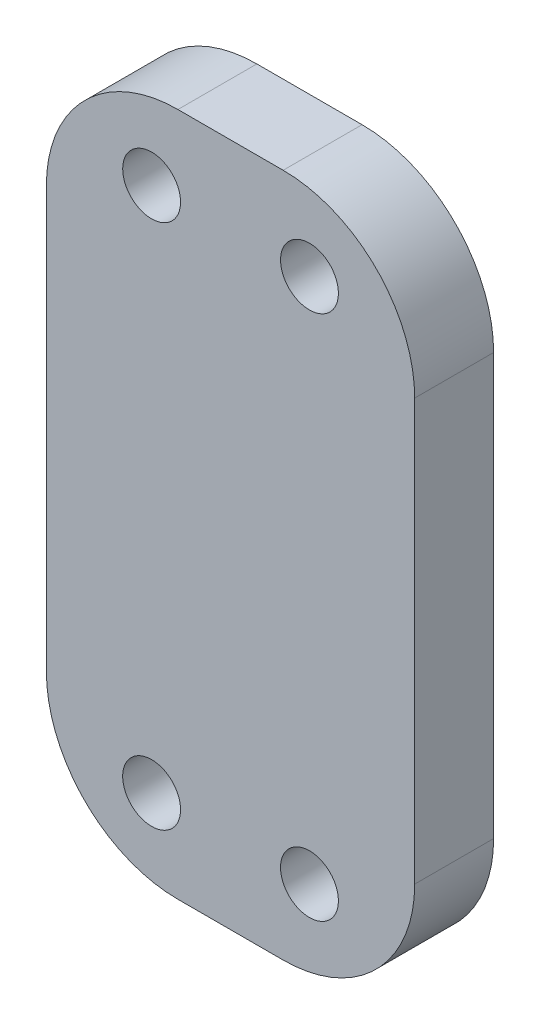
ISO-10303-21;
HEADER;
FILE_DESCRIPTION(('STEP AP214'),'2;1');
FILE_NAME('part.step','',(''),(''),'','','');
FILE_SCHEMA(('AUTOMOTIVE_DESIGN { 1 0 10303 214 1 1 1 1 }'));
ENDSEC;
DATA;
#1=APPLICATION_CONTEXT('core data for automotive mechanical design processes');
#2=APPLICATION_PROTOCOL_DEFINITION('international standard','automotive_design',2000,#1);
#3=PRODUCT_CONTEXT('',#1,'mechanical');
#4=PRODUCT('Part','Part','',(#3));
#5=PRODUCT_RELATED_PRODUCT_CATEGORY('part','',(#4));
#6=PRODUCT_DEFINITION_FORMATION('','',#4);
#7=PRODUCT_DEFINITION_CONTEXT('part definition',#1,'design');
#8=PRODUCT_DEFINITION('design','',#6,#7);
#9=PRODUCT_DEFINITION_SHAPE('','',#8);
#10=(LENGTH_UNIT() NAMED_UNIT(*) SI_UNIT(.MILLI.,.METRE.));
#11=(NAMED_UNIT(*) PLANE_ANGLE_UNIT() SI_UNIT($,.RADIAN.));
#12=(NAMED_UNIT(*) SI_UNIT($,.STERADIAN.) SOLID_ANGLE_UNIT());
#13=UNCERTAINTY_MEASURE_WITH_UNIT(LENGTH_MEASURE(1.E-05),#10,'distance_accuracy_value','');
#14=(GEOMETRIC_REPRESENTATION_CONTEXT(3) GLOBAL_UNCERTAINTY_ASSIGNED_CONTEXT((#13)) GLOBAL_UNIT_ASSIGNED_CONTEXT((#10,
#11,#12)) REPRESENTATION_CONTEXT('',''));
#15=CARTESIAN_POINT('',(0.,0.,0.));
#16=DIRECTION('',(0.,0.,1.));
#17=DIRECTION('',(1.,0.,0.));
#18=AXIS2_PLACEMENT_3D('',#15,#16,#17);
#19=CARTESIAN_POINT('',(0.,0.,3.));
#20=DIRECTION('',(0.,0.,1.));
#21=DIRECTION('',(1.,0.,0.));
#22=AXIS2_PLACEMENT_3D('',#19,#20,#21);
#23=PLANE('',#22);
#24=CARTESIAN_POINT('',(3.,-10.,3.));
#25=DIRECTION('',(0.,0.,1.));
#26=DIRECTION('',(-1.,0.,0.));
#27=AXIS2_PLACEMENT_3D('',#24,#25,#26);
#28=CIRCLE('',#27,1.1);
#29=CARTESIAN_POINT('',(1.9,-10.,3.));
#30=VERTEX_POINT('',#29);
#31=EDGE_CURVE('E189',#30,#30,#28,.T.);
#32=ORIENTED_EDGE('',*,*,#31,.F.);
#33=EDGE_LOOP('',(#32));
#34=FACE_BOUND('',#33,.T.);
#35=CARTESIAN_POINT('',(3.,10.,3.));
#36=DIRECTION('',(0.,0.,1.));
#37=DIRECTION('',(1.,0.,0.));
#38=AXIS2_PLACEMENT_3D('',#35,#36,#37);
#39=CIRCLE('',#38,1.1);
#40=CARTESIAN_POINT('',(4.1,10.,3.));
#41=VERTEX_POINT('',#40);
#42=EDGE_CURVE('E175',#41,#41,#39,.T.);
#43=ORIENTED_EDGE('',*,*,#42,.F.);
#44=EDGE_LOOP('',(#43));
#45=FACE_BOUND('',#44,.T.);
#46=DIRECTION('',(1.,0.,0.));
#47=VECTOR('',#46,1.);
#48=CARTESIAN_POINT('',(7.,-13.,3.));
#49=LINE('',#48,#47);
#50=CARTESIAN_POINT('',(-2.,-13.,3.));
#51=VERTEX_POINT('',#50);
#52=CARTESIAN_POINT('',(2.,-13.,3.));
#53=VERTEX_POINT('',#52);
#54=EDGE_CURVE('E169',#51,#53,#49,.T.);
#55=ORIENTED_EDGE('',*,*,#54,.T.);
#56=CARTESIAN_POINT('',(2.,-8.,3.));
#57=DIRECTION('',(0.,0.,1.));
#58=DIRECTION('',(1.,0.,0.));
#59=AXIS2_PLACEMENT_3D('',#56,#57,#58);
#60=CIRCLE('',#59,5.);
#61=CARTESIAN_POINT('',(7.,-8.,3.));
#62=VERTEX_POINT('',#61);
#63=EDGE_CURVE('E149',#53,#62,#60,.T.);
#64=ORIENTED_EDGE('',*,*,#63,.T.);
#65=DIRECTION('',(0.,1.,0.));
#66=VECTOR('',#65,1.);
#67=CARTESIAN_POINT('',(7.,-13.,3.));
#68=LINE('',#67,#66);
#69=CARTESIAN_POINT('',(7.,7.99999999999999,3.));
#70=VERTEX_POINT('',#69);
#71=EDGE_CURVE('E119',#62,#70,#68,.T.);
#72=ORIENTED_EDGE('',*,*,#71,.T.);
#73=CARTESIAN_POINT('',(2.,8.,3.));
#74=DIRECTION('',(0.,0.,1.));
#75=DIRECTION('',(1.,0.,0.));
#76=AXIS2_PLACEMENT_3D('',#73,#74,#75);
#77=CIRCLE('',#76,5.);
#78=CARTESIAN_POINT('',(2.,13.,3.));
#79=VERTEX_POINT('',#78);
#80=EDGE_CURVE('E55',#70,#79,#77,.T.);
#81=ORIENTED_EDGE('',*,*,#80,.T.);
#82=DIRECTION('',(-1.,0.,0.));
#83=VECTOR('',#82,1.);
#84=CARTESIAN_POINT('',(7.,13.,3.));
#85=LINE('',#84,#83);
#86=CARTESIAN_POINT('',(-2.,13.,3.));
#87=VERTEX_POINT('',#86);
#88=EDGE_CURVE('E136',#79,#87,#85,.T.);
#89=ORIENTED_EDGE('',*,*,#88,.T.);
#90=CARTESIAN_POINT('',(-2.,8.,3.));
#91=DIRECTION('',(0.,0.,1.));
#92=DIRECTION('',(1.,0.,0.));
#93=AXIS2_PLACEMENT_3D('',#90,#91,#92);
#94=CIRCLE('',#93,5.);
#95=CARTESIAN_POINT('',(-7.,7.99999999999999,3.));
#96=VERTEX_POINT('',#95);
#97=EDGE_CURVE('E144',#87,#96,#94,.T.);
#98=ORIENTED_EDGE('',*,*,#97,.T.);
#99=DIRECTION('',(0.,-1.,0.));
#100=VECTOR('',#99,1.);
#101=CARTESIAN_POINT('',(-7.,-13.,3.));
#102=LINE('',#101,#100);
#103=CARTESIAN_POINT('',(-7.,-8.,3.));
#104=VERTEX_POINT('',#103);
#105=EDGE_CURVE('E130',#96,#104,#102,.T.);
#106=ORIENTED_EDGE('',*,*,#105,.T.);
#107=CARTESIAN_POINT('',(-2.,-8.,3.));
#108=DIRECTION('',(0.,0.,1.));
#109=DIRECTION('',(1.,0.,0.));
#110=AXIS2_PLACEMENT_3D('',#107,#108,#109);
#111=CIRCLE('',#110,5.);
#112=EDGE_CURVE('E147',#104,#51,#111,.T.);
#113=ORIENTED_EDGE('',*,*,#112,.T.);
#114=EDGE_LOOP('',(#55,#64,#72,#81,#89,#98,#106,#113));
#115=FACE_BOUND('',#114,.T.);
#116=CARTESIAN_POINT('',(-3.,10.,3.));
#117=DIRECTION('',(0.,0.,1.));
#118=DIRECTION('',(-1.,0.,0.));
#119=AXIS2_PLACEMENT_3D('',#116,#117,#118);
#120=CIRCLE('',#119,1.1);
#121=CARTESIAN_POINT('',(-4.1,10.,3.));
#122=VERTEX_POINT('',#121);
#123=EDGE_CURVE('E184',#122,#122,#120,.T.);
#124=ORIENTED_EDGE('',*,*,#123,.F.);
#125=EDGE_LOOP('',(#124));
#126=FACE_BOUND('',#125,.T.);
#127=CARTESIAN_POINT('',(-3.,-10.,3.));
#128=DIRECTION('',(0.,0.,1.));
#129=DIRECTION('',(1.,0.,0.));
#130=AXIS2_PLACEMENT_3D('',#127,#128,#129);
#131=CIRCLE('',#130,1.1);
#132=CARTESIAN_POINT('',(-1.9,-10.,3.));
#133=VERTEX_POINT('',#132);
#134=EDGE_CURVE('E195',#133,#133,#131,.T.);
#135=ORIENTED_EDGE('',*,*,#134,.F.);
#136=EDGE_LOOP('',(#135));
#137=FACE_BOUND('',#136,.T.);
#138=ADVANCED_FACE('F34',(#34,#45,#115,#126,#137),#23,.T.);
#139=CARTESIAN_POINT('',(0.,0.,0.));
#140=DIRECTION('',(0.,0.,1.));
#141=DIRECTION('',(1.,0.,0.));
#142=AXIS2_PLACEMENT_3D('',#139,#140,#141);
#143=PLANE('',#142);
#144=DIRECTION('',(0.,1.,0.));
#145=VECTOR('',#144,1.);
#146=CARTESIAN_POINT('',(7.,-13.,0.));
#147=LINE('',#146,#145);
#148=CARTESIAN_POINT('',(7.,-8.,0.));
#149=VERTEX_POINT('',#148);
#150=CARTESIAN_POINT('',(7.,7.99999999999999,0.));
#151=VERTEX_POINT('',#150);
#152=EDGE_CURVE('E117',#149,#151,#147,.T.);
#153=ORIENTED_EDGE('',*,*,#152,.F.);
#154=CARTESIAN_POINT('',(2.,-8.,0.));
#155=DIRECTION('',(0.,0.,1.));
#156=DIRECTION('',(1.,0.,0.));
#157=AXIS2_PLACEMENT_3D('',#154,#155,#156);
#158=CIRCLE('',#157,5.);
#159=CARTESIAN_POINT('',(2.,-13.,0.));
#160=VERTEX_POINT('',#159);
#161=EDGE_CURVE('E100',#149,#160,#158,.F.);
#162=ORIENTED_EDGE('',*,*,#161,.T.);
#163=DIRECTION('',(1.,0.,0.));
#164=VECTOR('',#163,1.);
#165=CARTESIAN_POINT('',(7.,-13.,0.));
#166=LINE('',#165,#164);
#167=CARTESIAN_POINT('',(-2.,-13.,0.));
#168=VERTEX_POINT('',#167);
#169=EDGE_CURVE('E128',#168,#160,#166,.T.);
#170=ORIENTED_EDGE('',*,*,#169,.F.);
#171=CARTESIAN_POINT('',(-2.,-8.,0.));
#172=DIRECTION('',(0.,0.,1.));
#173=DIRECTION('',(1.,0.,0.));
#174=AXIS2_PLACEMENT_3D('',#171,#172,#173);
#175=CIRCLE('',#174,5.);
#176=CARTESIAN_POINT('',(-7.,-8.,0.));
#177=VERTEX_POINT('',#176);
#178=EDGE_CURVE('E111',#168,#177,#175,.F.);
#179=ORIENTED_EDGE('',*,*,#178,.T.);
#180=DIRECTION('',(0.,-1.,0.));
#181=VECTOR('',#180,1.);
#182=CARTESIAN_POINT('',(-7.,-13.,0.));
#183=LINE('',#182,#181);
#184=CARTESIAN_POINT('',(-7.,7.99999999999999,0.));
#185=VERTEX_POINT('',#184);
#186=EDGE_CURVE('E132',#185,#177,#183,.T.);
#187=ORIENTED_EDGE('',*,*,#186,.F.);
#188=CARTESIAN_POINT('',(-2.,8.,0.));
#189=DIRECTION('',(0.,0.,1.));
#190=DIRECTION('',(1.,0.,0.));
#191=AXIS2_PLACEMENT_3D('',#188,#189,#190);
#192=CIRCLE('',#191,5.);
#193=CARTESIAN_POINT('',(-2.,13.,0.));
#194=VERTEX_POINT('',#193);
#195=EDGE_CURVE('E120',#185,#194,#192,.F.);
#196=ORIENTED_EDGE('',*,*,#195,.T.);
#197=DIRECTION('',(-1.,0.,0.));
#198=VECTOR('',#197,1.);
#199=CARTESIAN_POINT('',(7.,13.,0.));
#200=LINE('',#199,#198);
#201=CARTESIAN_POINT('',(2.,13.,0.));
#202=VERTEX_POINT('',#201);
#203=EDGE_CURVE('E127',#202,#194,#200,.T.);
#204=ORIENTED_EDGE('',*,*,#203,.F.);
#205=CARTESIAN_POINT('',(2.,8.,0.));
#206=DIRECTION('',(0.,0.,1.));
#207=DIRECTION('',(1.,0.,0.));
#208=AXIS2_PLACEMENT_3D('',#205,#206,#207);
#209=CIRCLE('',#208,5.);
#210=EDGE_CURVE('E126',#202,#151,#209,.F.);
#211=ORIENTED_EDGE('',*,*,#210,.T.);
#212=EDGE_LOOP('',(#153,#162,#170,#179,#187,#196,#204,#211));
#213=FACE_BOUND('',#212,.T.);
#214=CARTESIAN_POINT('',(3.,10.,0.));
#215=DIRECTION('',(0.,0.,1.));
#216=DIRECTION('',(1.,0.,0.));
#217=AXIS2_PLACEMENT_3D('',#214,#215,#216);
#218=CIRCLE('',#217,1.1);
#219=CARTESIAN_POINT('',(4.1,10.,0.));
#220=VERTEX_POINT('',#219);
#221=EDGE_CURVE('E177',#220,#220,#218,.T.);
#222=ORIENTED_EDGE('',*,*,#221,.T.);
#223=EDGE_LOOP('',(#222));
#224=FACE_BOUND('',#223,.T.);
#225=CARTESIAN_POINT('',(-3.,10.,0.));
#226=DIRECTION('',(0.,0.,1.));
#227=DIRECTION('',(-1.,0.,0.));
#228=AXIS2_PLACEMENT_3D('',#225,#226,#227);
#229=CIRCLE('',#228,1.1);
#230=CARTESIAN_POINT('',(-4.1,10.,0.));
#231=VERTEX_POINT('',#230);
#232=EDGE_CURVE('E186',#231,#231,#229,.T.);
#233=ORIENTED_EDGE('',*,*,#232,.T.);
#234=EDGE_LOOP('',(#233));
#235=FACE_BOUND('',#234,.T.);
#236=CARTESIAN_POINT('',(3.,-10.,0.));
#237=DIRECTION('',(0.,0.,1.));
#238=DIRECTION('',(-1.,0.,0.));
#239=AXIS2_PLACEMENT_3D('',#236,#237,#238);
#240=CIRCLE('',#239,1.1);
#241=CARTESIAN_POINT('',(1.9,-10.,0.));
#242=VERTEX_POINT('',#241);
#243=EDGE_CURVE('E192',#242,#242,#240,.T.);
#244=ORIENTED_EDGE('',*,*,#243,.T.);
#245=EDGE_LOOP('',(#244));
#246=FACE_BOUND('',#245,.T.);
#247=CARTESIAN_POINT('',(-3.,-10.,0.));
#248=DIRECTION('',(0.,0.,1.));
#249=DIRECTION('',(1.,0.,0.));
#250=AXIS2_PLACEMENT_3D('',#247,#248,#249);
#251=CIRCLE('',#250,1.1);
#252=CARTESIAN_POINT('',(-1.9,-10.,0.));
#253=VERTEX_POINT('',#252);
#254=EDGE_CURVE('E198',#253,#253,#251,.T.);
#255=ORIENTED_EDGE('',*,*,#254,.T.);
#256=EDGE_LOOP('',(#255));
#257=FACE_BOUND('',#256,.T.);
#258=ADVANCED_FACE('F123',(#213,#224,#235,#246,#257),#143,.F.);
#259=CARTESIAN_POINT('',(-7.,-13.,3.));
#260=DIRECTION('',(1.,0.,0.));
#261=DIRECTION('',(0.,0.,-1.));
#262=AXIS2_PLACEMENT_3D('',#259,#260,#261);
#263=PLANE('',#262);
#264=ORIENTED_EDGE('',*,*,#186,.T.);
#265=DIRECTION('',(0.,0.,-1.));
#266=VECTOR('',#265,1.);
#267=CARTESIAN_POINT('',(-7.,-8.,3.));
#268=LINE('',#267,#266);
#269=EDGE_CURVE('E154',#177,#104,#268,.F.);
#270=ORIENTED_EDGE('',*,*,#269,.T.);
#271=ORIENTED_EDGE('',*,*,#105,.F.);
#272=DIRECTION('',(0.,0.,-1.));
#273=VECTOR('',#272,1.);
#274=CARTESIAN_POINT('',(-7.,8.,3.));
#275=LINE('',#274,#273);
#276=EDGE_CURVE('E151',#96,#185,#275,.T.);
#277=ORIENTED_EDGE('',*,*,#276,.T.);
#278=EDGE_LOOP('',(#264,#270,#271,#277));
#279=FACE_BOUND('',#278,.T.);
#280=ADVANCED_FACE('F160',(#279),#263,.F.);
#281=CARTESIAN_POINT('',(7.,-13.,3.));
#282=DIRECTION('',(0.,1.,0.));
#283=DIRECTION('',(0.,0.,1.));
#284=AXIS2_PLACEMENT_3D('',#281,#282,#283);
#285=PLANE('',#284);
#286=ORIENTED_EDGE('',*,*,#169,.T.);
#287=DIRECTION('',(0.,0.,-1.));
#288=VECTOR('',#287,1.);
#289=CARTESIAN_POINT('',(2.,-13.,3.));
#290=LINE('',#289,#288);
#291=EDGE_CURVE('E105',#160,#53,#290,.F.);
#292=ORIENTED_EDGE('',*,*,#291,.T.);
#293=ORIENTED_EDGE('',*,*,#54,.F.);
#294=DIRECTION('',(0.,0.,-1.));
#295=VECTOR('',#294,1.);
#296=CARTESIAN_POINT('',(-2.,-13.,3.));
#297=LINE('',#296,#295);
#298=EDGE_CURVE('E110',#51,#168,#297,.T.);
#299=ORIENTED_EDGE('',*,*,#298,.T.);
#300=EDGE_LOOP('',(#286,#292,#293,#299));
#301=FACE_BOUND('',#300,.T.);
#302=ADVANCED_FACE('F174',(#301),#285,.F.);
#303=CARTESIAN_POINT('',(7.,-13.,3.));
#304=DIRECTION('',(-1.,0.,0.));
#305=DIRECTION('',(0.,0.,1.));
#306=AXIS2_PLACEMENT_3D('',#303,#304,#305);
#307=PLANE('',#306);
#308=ORIENTED_EDGE('',*,*,#71,.F.);
#309=DIRECTION('',(0.,0.,-1.));
#310=VECTOR('',#309,1.);
#311=CARTESIAN_POINT('',(7.,-8.,3.));
#312=LINE('',#311,#310);
#313=EDGE_CURVE('E104',#62,#149,#312,.T.);
#314=ORIENTED_EDGE('',*,*,#313,.T.);
#315=ORIENTED_EDGE('',*,*,#152,.T.);
#316=DIRECTION('',(0.,0.,-1.));
#317=VECTOR('',#316,1.);
#318=CARTESIAN_POINT('',(7.,8.,3.));
#319=LINE('',#318,#317);
#320=EDGE_CURVE('E121',#151,#70,#319,.F.);
#321=ORIENTED_EDGE('',*,*,#320,.T.);
#322=EDGE_LOOP('',(#308,#314,#315,#321));
#323=FACE_BOUND('',#322,.T.);
#324=ADVANCED_FACE('F116',(#323),#307,.F.);
#325=CARTESIAN_POINT('',(7.,13.,3.));
#326=DIRECTION('',(0.,-1.,0.));
#327=DIRECTION('',(0.,0.,-1.));
#328=AXIS2_PLACEMENT_3D('',#325,#326,#327);
#329=PLANE('',#328);
#330=ORIENTED_EDGE('',*,*,#88,.F.);
#331=DIRECTION('',(0.,0.,-1.));
#332=VECTOR('',#331,1.);
#333=CARTESIAN_POINT('',(2.,13.,3.));
#334=LINE('',#333,#332);
#335=EDGE_CURVE('E11',#79,#202,#334,.T.);
#336=ORIENTED_EDGE('',*,*,#335,.T.);
#337=ORIENTED_EDGE('',*,*,#203,.T.);
#338=DIRECTION('',(0.,0.,-1.));
#339=VECTOR('',#338,1.);
#340=CARTESIAN_POINT('',(-2.,13.,3.));
#341=LINE('',#340,#339);
#342=EDGE_CURVE('E42',#194,#87,#341,.F.);
#343=ORIENTED_EDGE('',*,*,#342,.T.);
#344=EDGE_LOOP('',(#330,#336,#337,#343));
#345=FACE_BOUND('',#344,.T.);
#346=ADVANCED_FACE('F220',(#345),#329,.F.);
#347=CARTESIAN_POINT('',(3.,10.,3.));
#348=DIRECTION('',(0.,0.,-1.));
#349=DIRECTION('',(-1.,0.,0.));
#350=AXIS2_PLACEMENT_3D('',#347,#348,#349);
#351=CYLINDRICAL_SURFACE('',#350,1.1);
#352=ORIENTED_EDGE('',*,*,#42,.T.);
#353=EDGE_LOOP('',(#352));
#354=FACE_BOUND('',#353,.T.);
#355=ORIENTED_EDGE('',*,*,#221,.F.);
#356=EDGE_LOOP('',(#355));
#357=FACE_BOUND('',#356,.T.);
#358=ADVANCED_FACE('F217',(#354,#357),#351,.F.);
#359=CARTESIAN_POINT('',(-3.,10.,3.));
#360=DIRECTION('',(0.,0.,-1.));
#361=DIRECTION('',(-1.,0.,0.));
#362=AXIS2_PLACEMENT_3D('',#359,#360,#361);
#363=CYLINDRICAL_SURFACE('',#362,1.1);
#364=ORIENTED_EDGE('',*,*,#123,.T.);
#365=EDGE_LOOP('',(#364));
#366=FACE_BOUND('',#365,.T.);
#367=ORIENTED_EDGE('',*,*,#232,.F.);
#368=EDGE_LOOP('',(#367));
#369=FACE_BOUND('',#368,.T.);
#370=ADVANCED_FACE('F312',(#366,#369),#363,.F.);
#371=CARTESIAN_POINT('',(3.,-10.,3.));
#372=DIRECTION('',(0.,0.,-1.));
#373=DIRECTION('',(-1.,0.,0.));
#374=AXIS2_PLACEMENT_3D('',#371,#372,#373);
#375=CYLINDRICAL_SURFACE('',#374,1.1);
#376=ORIENTED_EDGE('',*,*,#31,.T.);
#377=EDGE_LOOP('',(#376));
#378=FACE_BOUND('',#377,.T.);
#379=ORIENTED_EDGE('',*,*,#243,.F.);
#380=EDGE_LOOP('',(#379));
#381=FACE_BOUND('',#380,.T.);
#382=ADVANCED_FACE('F303',(#378,#381),#375,.F.);
#383=CARTESIAN_POINT('',(-3.,-10.,3.));
#384=DIRECTION('',(0.,0.,-1.));
#385=DIRECTION('',(-1.,0.,0.));
#386=AXIS2_PLACEMENT_3D('',#383,#384,#385);
#387=CYLINDRICAL_SURFACE('',#386,1.1);
#388=ORIENTED_EDGE('',*,*,#134,.T.);
#389=EDGE_LOOP('',(#388));
#390=FACE_BOUND('',#389,.T.);
#391=ORIENTED_EDGE('',*,*,#254,.F.);
#392=EDGE_LOOP('',(#391));
#393=FACE_BOUND('',#392,.T.);
#394=ADVANCED_FACE('F204',(#390,#393),#387,.F.);
#395=CARTESIAN_POINT('',(2.,-8.,3.));
#396=DIRECTION('',(0.,0.,-1.));
#397=DIRECTION('',(-1.,0.,0.));
#398=AXIS2_PLACEMENT_3D('',#395,#396,#397);
#399=CYLINDRICAL_SURFACE('',#398,5.);
#400=ORIENTED_EDGE('',*,*,#63,.F.);
#401=ORIENTED_EDGE('',*,*,#291,.F.);
#402=ORIENTED_EDGE('',*,*,#161,.F.);
#403=ORIENTED_EDGE('',*,*,#313,.F.);
#404=EDGE_LOOP('',(#400,#401,#402,#403));
#405=FACE_BOUND('',#404,.T.);
#406=ADVANCED_FACE('F103',(#405),#399,.T.);
#407=CARTESIAN_POINT('',(-2.,-8.,3.));
#408=DIRECTION('',(0.,0.,-1.));
#409=DIRECTION('',(-1.,0.,0.));
#410=AXIS2_PLACEMENT_3D('',#407,#408,#409);
#411=CYLINDRICAL_SURFACE('',#410,5.);
#412=ORIENTED_EDGE('',*,*,#112,.F.);
#413=ORIENTED_EDGE('',*,*,#269,.F.);
#414=ORIENTED_EDGE('',*,*,#178,.F.);
#415=ORIENTED_EDGE('',*,*,#298,.F.);
#416=EDGE_LOOP('',(#412,#413,#414,#415));
#417=FACE_BOUND('',#416,.T.);
#418=ADVANCED_FACE('F172',(#417),#411,.T.);
#419=CARTESIAN_POINT('',(2.,8.,3.));
#420=DIRECTION('',(0.,0.,-1.));
#421=DIRECTION('',(-1.,0.,0.));
#422=AXIS2_PLACEMENT_3D('',#419,#420,#421);
#423=CYLINDRICAL_SURFACE('',#422,5.);
#424=ORIENTED_EDGE('',*,*,#80,.F.);
#425=ORIENTED_EDGE('',*,*,#320,.F.);
#426=ORIENTED_EDGE('',*,*,#210,.F.);
#427=ORIENTED_EDGE('',*,*,#335,.F.);
#428=EDGE_LOOP('',(#424,#425,#426,#427));
#429=FACE_BOUND('',#428,.T.);
#430=ADVANCED_FACE('F232',(#429),#423,.T.);
#431=CARTESIAN_POINT('',(-2.,8.,3.));
#432=DIRECTION('',(0.,0.,-1.));
#433=DIRECTION('',(-1.,0.,0.));
#434=AXIS2_PLACEMENT_3D('',#431,#432,#433);
#435=CYLINDRICAL_SURFACE('',#434,5.);
#436=ORIENTED_EDGE('',*,*,#97,.F.);
#437=ORIENTED_EDGE('',*,*,#342,.F.);
#438=ORIENTED_EDGE('',*,*,#195,.F.);
#439=ORIENTED_EDGE('',*,*,#276,.F.);
#440=EDGE_LOOP('',(#436,#437,#438,#439));
#441=FACE_BOUND('',#440,.T.);
#442=ADVANCED_FACE('F36',(#441),#435,.T.);
#443=CLOSED_SHELL('',(#138,#258,#280,#302,#324,#346,#358,#370,#382,#394,#406,#418,#430,#442));
#444=MANIFOLD_SOLID_BREP('B2',#443);
#445=ADVANCED_BREP_SHAPE_REPRESENTATION('',(#18,#444),#14);
#446=SHAPE_DEFINITION_REPRESENTATION(#9,#445);
ENDSEC;
END-ISO-10303-21;
